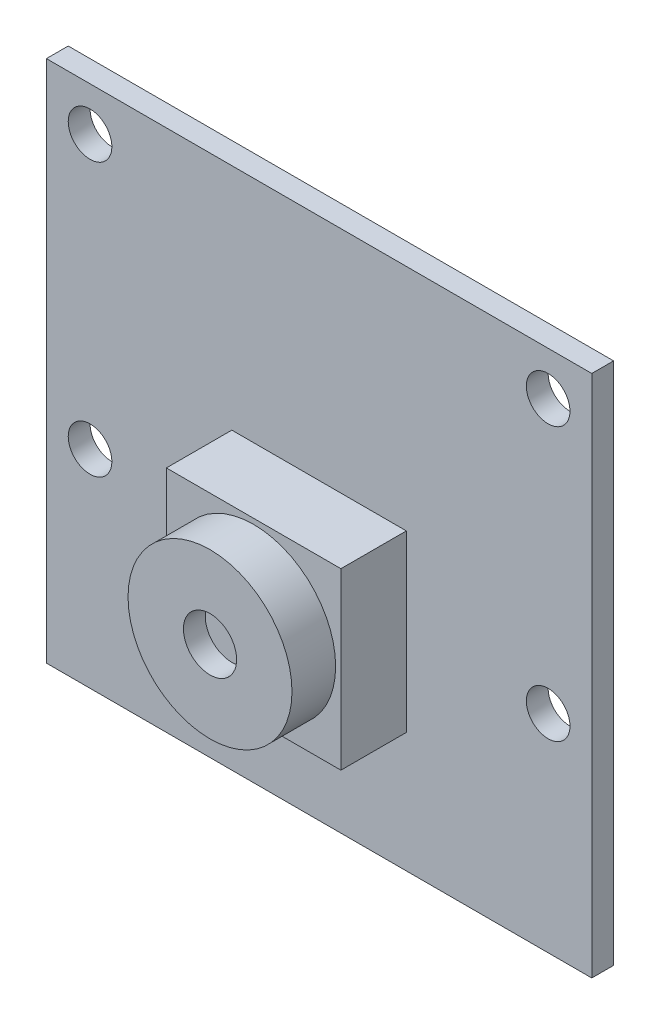
ISO-10303-21;
HEADER;
FILE_DESCRIPTION(('STEP AP214'),'2;1');
FILE_NAME('part.step','',(''),(''),'','','');
FILE_SCHEMA(('AUTOMOTIVE_DESIGN { 1 0 10303 214 1 1 1 1 }'));
ENDSEC;
DATA;
#1=APPLICATION_CONTEXT('core data for automotive mechanical design processes');
#2=APPLICATION_PROTOCOL_DEFINITION('international standard','automotive_design',2000,#1);
#3=PRODUCT_CONTEXT('',#1,'mechanical');
#4=PRODUCT('Part','Part','',(#3));
#5=PRODUCT_RELATED_PRODUCT_CATEGORY('part','',(#4));
#6=PRODUCT_DEFINITION_FORMATION('','',#4);
#7=PRODUCT_DEFINITION_CONTEXT('part definition',#1,'design');
#8=PRODUCT_DEFINITION('design','',#6,#7);
#9=PRODUCT_DEFINITION_SHAPE('','',#8);
#10=(LENGTH_UNIT() NAMED_UNIT(*) SI_UNIT(.MILLI.,.METRE.));
#11=(NAMED_UNIT(*) PLANE_ANGLE_UNIT() SI_UNIT($,.RADIAN.));
#12=(NAMED_UNIT(*) SI_UNIT($,.STERADIAN.) SOLID_ANGLE_UNIT());
#13=UNCERTAINTY_MEASURE_WITH_UNIT(LENGTH_MEASURE(1.E-05),#10,'distance_accuracy_value','');
#14=(GEOMETRIC_REPRESENTATION_CONTEXT(3) GLOBAL_UNCERTAINTY_ASSIGNED_CONTEXT((#13)) GLOBAL_UNIT_ASSIGNED_CONTEXT((#10,
#11,#12)) REPRESENTATION_CONTEXT('',''));
#15=CARTESIAN_POINT('',(0.,0.,0.));
#16=DIRECTION('',(0.,0.,1.));
#17=DIRECTION('',(1.,0.,0.));
#18=AXIS2_PLACEMENT_3D('',#15,#16,#17);
#19=CARTESIAN_POINT('',(0.,-2.50000000000002,6.));
#20=DIRECTION('',(0.,0.,-1.));
#21=DIRECTION('',(-1.,0.,0.));
#22=AXIS2_PLACEMENT_3D('',#19,#20,#21);
#23=CYLINDRICAL_SURFACE('',#22,3.75777799068408);
#24=CARTESIAN_POINT('',(0.,-2.50000000000002,6.));
#25=DIRECTION('',(0.,0.,1.));
#26=DIRECTION('',(1.,0.,0.));
#27=AXIS2_PLACEMENT_3D('',#24,#25,#26);
#28=CIRCLE('',#27,3.75777799068408);
#29=CARTESIAN_POINT('',(3.75777799068408,-2.50000000000002,6.));
#30=VERTEX_POINT('',#29);
#31=EDGE_CURVE('E11',#30,#30,#28,.T.);
#32=ORIENTED_EDGE('',*,*,#31,.F.);
#33=EDGE_LOOP('',(#32));
#34=FACE_BOUND('',#33,.T.);
#35=CARTESIAN_POINT('',(0.,-2.50000000000002,4.));
#36=DIRECTION('',(0.,0.,1.));
#37=DIRECTION('',(1.,0.,0.));
#38=AXIS2_PLACEMENT_3D('',#35,#36,#37);
#39=CIRCLE('',#38,3.75777799068408);
#40=CARTESIAN_POINT('',(3.75777799068408,-2.50000000000002,4.));
#41=VERTEX_POINT('',#40);
#42=EDGE_CURVE('E53',#41,#41,#39,.T.);
#43=ORIENTED_EDGE('',*,*,#42,.T.);
#44=EDGE_LOOP('',(#43));
#45=FACE_BOUND('',#44,.T.);
#46=ADVANCED_FACE('F50',(#34,#45),#23,.T.);
#47=CARTESIAN_POINT('',(0.,-2.50000000000002,6.));
#48=DIRECTION('',(0.,0.,1.));
#49=DIRECTION('',(1.,0.,0.));
#50=AXIS2_PLACEMENT_3D('',#47,#48,#49);
#51=PLANE('',#50);
#52=CARTESIAN_POINT('',(0.,-2.50000000000002,6.));
#53=DIRECTION('',(0.,0.,1.));
#54=DIRECTION('',(1.,0.,0.));
#55=AXIS2_PLACEMENT_3D('',#52,#53,#54);
#56=CIRCLE('',#55,1.21903368647642);
#57=CARTESIAN_POINT('',(1.21903368647642,-2.50000000000002,6.));
#58=VERTEX_POINT('',#57);
#59=EDGE_CURVE('E62',#58,#58,#56,.T.);
#60=ORIENTED_EDGE('',*,*,#59,.F.);
#61=EDGE_LOOP('',(#60));
#62=FACE_BOUND('',#61,.T.);
#63=ORIENTED_EDGE('',*,*,#31,.T.);
#64=EDGE_LOOP('',(#63));
#65=FACE_BOUND('',#64,.T.);
#66=ADVANCED_FACE('F77',(#62,#65),#51,.T.);
#67=CARTESIAN_POINT('',(0.,-2.50000000000002,4.));
#68=DIRECTION('',(0.,0.,1.));
#69=DIRECTION('',(1.,0.,0.));
#70=AXIS2_PLACEMENT_3D('',#67,#68,#69);
#71=PLANE('',#70);
#72=ORIENTED_EDGE('',*,*,#42,.F.);
#73=EDGE_LOOP('',(#72));
#74=FACE_BOUND('',#73,.T.);
#75=ADVANCED_FACE('F73',(#74),#71,.F.);
#76=CARTESIAN_POINT('',(0.,-2.50000000000002,5.));
#77=DIRECTION('',(0.,0.,1.));
#78=DIRECTION('',(1.,0.,0.));
#79=AXIS2_PLACEMENT_3D('',#76,#77,#78);
#80=CYLINDRICAL_SURFACE('',#79,1.21903368647642);
#81=CARTESIAN_POINT('',(0.,-2.50000000000002,5.));
#82=DIRECTION('',(0.,0.,1.));
#83=DIRECTION('',(1.,0.,0.));
#84=AXIS2_PLACEMENT_3D('',#81,#82,#83);
#85=CIRCLE('',#84,1.21903368647642);
#86=CARTESIAN_POINT('',(1.21903368647642,-2.50000000000002,5.));
#87=VERTEX_POINT('',#86);
#88=EDGE_CURVE('E60',#87,#87,#85,.T.);
#89=ORIENTED_EDGE('',*,*,#88,.F.);
#90=EDGE_LOOP('',(#89));
#91=FACE_BOUND('',#90,.T.);
#92=ORIENTED_EDGE('',*,*,#59,.T.);
#93=EDGE_LOOP('',(#92));
#94=FACE_BOUND('',#93,.T.);
#95=ADVANCED_FACE('F70',(#91,#94),#80,.F.);
#96=CARTESIAN_POINT('',(0.,-2.50000000000002,5.));
#97=DIRECTION('',(0.,0.,1.));
#98=DIRECTION('',(1.,0.,0.));
#99=AXIS2_PLACEMENT_3D('',#96,#97,#98);
#100=PLANE('',#99);
#101=ORIENTED_EDGE('',*,*,#88,.T.);
#102=EDGE_LOOP('',(#101));
#103=FACE_BOUND('',#102,.T.);
#104=ADVANCED_FACE('F68',(#103),#100,.T.);
#105=CLOSED_SHELL('',(#46,#66,#75,#95,#104));
#106=MANIFOLD_SOLID_BREP('B2',#105);
#107=CARTESIAN_POINT('',(4.,-6.5,4.));
#108=DIRECTION('',(-1.,0.,0.));
#109=DIRECTION('',(0.,-1.,0.));
#110=AXIS2_PLACEMENT_3D('',#107,#108,#109);
#111=PLANE('',#110);
#112=DIRECTION('',(0.,1.,0.));
#113=VECTOR('',#112,1.);
#114=CARTESIAN_POINT('',(4.,-6.5,1.));
#115=LINE('',#114,#113);
#116=CARTESIAN_POINT('',(4.,-6.5,1.));
#117=VERTEX_POINT('',#116);
#118=CARTESIAN_POINT('',(4.,1.5,1.));
#119=VERTEX_POINT('',#118);
#120=EDGE_CURVE('E194',#117,#119,#115,.T.);
#121=ORIENTED_EDGE('',*,*,#120,.T.);
#122=DIRECTION('',(0.,0.,-1.));
#123=VECTOR('',#122,1.);
#124=CARTESIAN_POINT('',(4.,1.5,4.));
#125=LINE('',#124,#123);
#126=CARTESIAN_POINT('',(4.,1.5,4.));
#127=VERTEX_POINT('',#126);
#128=EDGE_CURVE('E48',#127,#119,#125,.T.);
#129=ORIENTED_EDGE('',*,*,#128,.F.);
#130=DIRECTION('',(0.,1.,0.));
#131=VECTOR('',#130,1.);
#132=CARTESIAN_POINT('',(4.,-6.5,4.));
#133=LINE('',#132,#131);
#134=CARTESIAN_POINT('',(4.,-6.5,4.));
#135=VERTEX_POINT('',#134);
#136=EDGE_CURVE('E182',#135,#127,#133,.T.);
#137=ORIENTED_EDGE('',*,*,#136,.F.);
#138=DIRECTION('',(0.,0.,-1.));
#139=VECTOR('',#138,1.);
#140=CARTESIAN_POINT('',(4.,-6.5,4.));
#141=LINE('',#140,#139);
#142=EDGE_CURVE('E190',#135,#117,#141,.T.);
#143=ORIENTED_EDGE('',*,*,#142,.T.);
#144=EDGE_LOOP('',(#121,#129,#137,#143));
#145=FACE_BOUND('',#144,.T.);
#146=ADVANCED_FACE('F131',(#145),#111,.F.);
#147=CARTESIAN_POINT('',(-4.,1.5,4.));
#148=DIRECTION('',(0.,-1.,0.));
#149=DIRECTION('',(0.,0.,-1.));
#150=AXIS2_PLACEMENT_3D('',#147,#148,#149);
#151=PLANE('',#150);
#152=DIRECTION('',(-1.,0.,0.));
#153=VECTOR('',#152,1.);
#154=CARTESIAN_POINT('',(-4.,1.5,1.));
#155=LINE('',#154,#153);
#156=CARTESIAN_POINT('',(-4.,1.5,1.));
#157=VERTEX_POINT('',#156);
#158=EDGE_CURVE('E186',#119,#157,#155,.T.);
#159=ORIENTED_EDGE('',*,*,#158,.T.);
#160=DIRECTION('',(0.,0.,-1.));
#161=VECTOR('',#160,1.);
#162=CARTESIAN_POINT('',(-4.,1.5,4.));
#163=LINE('',#162,#161);
#164=CARTESIAN_POINT('',(-4.,1.5,4.));
#165=VERTEX_POINT('',#164);
#166=EDGE_CURVE('E139',#165,#157,#163,.T.);
#167=ORIENTED_EDGE('',*,*,#166,.F.);
#168=DIRECTION('',(-1.,0.,0.));
#169=VECTOR('',#168,1.);
#170=CARTESIAN_POINT('',(-4.,1.5,4.));
#171=LINE('',#170,#169);
#172=EDGE_CURVE('E177',#127,#165,#171,.T.);
#173=ORIENTED_EDGE('',*,*,#172,.F.);
#174=ORIENTED_EDGE('',*,*,#128,.T.);
#175=EDGE_LOOP('',(#159,#167,#173,#174));
#176=FACE_BOUND('',#175,.T.);
#177=ADVANCED_FACE('F185',(#176),#151,.F.);
#178=CARTESIAN_POINT('',(-4.,-6.5,4.));
#179=DIRECTION('',(1.,0.,0.));
#180=DIRECTION('',(0.,1.,0.));
#181=AXIS2_PLACEMENT_3D('',#178,#179,#180);
#182=PLANE('',#181);
#183=DIRECTION('',(0.,-1.,0.));
#184=VECTOR('',#183,1.);
#185=CARTESIAN_POINT('',(-4.,-6.5,1.));
#186=LINE('',#185,#184);
#187=CARTESIAN_POINT('',(-4.,-6.5,1.));
#188=VERTEX_POINT('',#187);
#189=EDGE_CURVE('E164',#157,#188,#186,.T.);
#190=ORIENTED_EDGE('',*,*,#189,.T.);
#191=DIRECTION('',(0.,0.,-1.));
#192=VECTOR('',#191,1.);
#193=CARTESIAN_POINT('',(-4.,-6.5,4.));
#194=LINE('',#193,#192);
#195=CARTESIAN_POINT('',(-4.,-6.5,4.));
#196=VERTEX_POINT('',#195);
#197=EDGE_CURVE('E187',#196,#188,#194,.T.);
#198=ORIENTED_EDGE('',*,*,#197,.F.);
#199=DIRECTION('',(0.,-1.,0.));
#200=VECTOR('',#199,1.);
#201=CARTESIAN_POINT('',(-4.,-6.5,4.));
#202=LINE('',#201,#200);
#203=EDGE_CURVE('E180',#165,#196,#202,.T.);
#204=ORIENTED_EDGE('',*,*,#203,.F.);
#205=ORIENTED_EDGE('',*,*,#166,.T.);
#206=EDGE_LOOP('',(#190,#198,#204,#205));
#207=FACE_BOUND('',#206,.T.);
#208=ADVANCED_FACE('F188',(#207),#182,.F.);
#209=CARTESIAN_POINT('',(-4.,-6.5,4.));
#210=DIRECTION('',(0.,1.,0.));
#211=DIRECTION('',(0.,0.,1.));
#212=AXIS2_PLACEMENT_3D('',#209,#210,#211);
#213=PLANE('',#212);
#214=DIRECTION('',(1.,0.,0.));
#215=VECTOR('',#214,1.);
#216=CARTESIAN_POINT('',(-4.,-6.5,1.));
#217=LINE('',#216,#215);
#218=EDGE_CURVE('E170',#188,#117,#217,.T.);
#219=ORIENTED_EDGE('',*,*,#218,.T.);
#220=ORIENTED_EDGE('',*,*,#142,.F.);
#221=DIRECTION('',(1.,0.,0.));
#222=VECTOR('',#221,1.);
#223=CARTESIAN_POINT('',(-4.,-6.5,4.));
#224=LINE('',#223,#222);
#225=EDGE_CURVE('E147',#196,#135,#224,.T.);
#226=ORIENTED_EDGE('',*,*,#225,.F.);
#227=ORIENTED_EDGE('',*,*,#197,.T.);
#228=EDGE_LOOP('',(#219,#220,#226,#227));
#229=FACE_BOUND('',#228,.T.);
#230=ADVANCED_FACE('F201',(#229),#213,.F.);
#231=CARTESIAN_POINT('',(0.,0.,4.));
#232=DIRECTION('',(0.,0.,-1.));
#233=DIRECTION('',(-1.,0.,0.));
#234=AXIS2_PLACEMENT_3D('',#231,#232,#233);
#235=PLANE('',#234);
#236=ORIENTED_EDGE('',*,*,#136,.T.);
#237=ORIENTED_EDGE('',*,*,#172,.T.);
#238=ORIENTED_EDGE('',*,*,#203,.T.);
#239=ORIENTED_EDGE('',*,*,#225,.T.);
#240=EDGE_LOOP('',(#236,#237,#238,#239));
#241=FACE_BOUND('',#240,.T.);
#242=ADVANCED_FACE('F178',(#241),#235,.F.);
#243=CARTESIAN_POINT('',(0.,0.,1.));
#244=DIRECTION('',(0.,0.,-1.));
#245=DIRECTION('',(-1.,0.,0.));
#246=AXIS2_PLACEMENT_3D('',#243,#244,#245);
#247=PLANE('',#246);
#248=ORIENTED_EDGE('',*,*,#120,.F.);
#249=ORIENTED_EDGE('',*,*,#218,.F.);
#250=ORIENTED_EDGE('',*,*,#189,.F.);
#251=ORIENTED_EDGE('',*,*,#158,.F.);
#252=EDGE_LOOP('',(#248,#249,#250,#251));
#253=FACE_BOUND('',#252,.T.);
#254=ADVANCED_FACE('F204',(#253),#247,.T.);
#255=CLOSED_SHELL('',(#146,#177,#208,#230,#242,#254));
#256=MANIFOLD_SOLID_BREP('B6',#255);
#257=CARTESIAN_POINT('',(12.5,-12.,1.));
#258=DIRECTION('',(-1.,0.,0.));
#259=DIRECTION('',(0.,0.,1.));
#260=AXIS2_PLACEMENT_3D('',#257,#258,#259);
#261=PLANE('',#260);
#262=DIRECTION('',(0.,1.,0.));
#263=VECTOR('',#262,1.);
#264=CARTESIAN_POINT('',(12.5,-12.,0.));
#265=LINE('',#264,#263);
#266=CARTESIAN_POINT('',(12.5,-12.,0.));
#267=VERTEX_POINT('',#266);
#268=CARTESIAN_POINT('',(12.5,12.,0.));
#269=VERTEX_POINT('',#268);
#270=EDGE_CURVE('E320',#267,#269,#265,.T.);
#271=ORIENTED_EDGE('',*,*,#270,.T.);
#272=DIRECTION('',(0.,0.,-1.));
#273=VECTOR('',#272,1.);
#274=CARTESIAN_POINT('',(12.5,12.,1.));
#275=LINE('',#274,#273);
#276=CARTESIAN_POINT('',(12.5,12.,1.));
#277=VERTEX_POINT('',#276);
#278=EDGE_CURVE('E129',#277,#269,#275,.T.);
#279=ORIENTED_EDGE('',*,*,#278,.F.);
#280=DIRECTION('',(0.,1.,0.));
#281=VECTOR('',#280,1.);
#282=CARTESIAN_POINT('',(12.5,-12.,1.));
#283=LINE('',#282,#281);
#284=CARTESIAN_POINT('',(12.5,-12.,1.));
#285=VERTEX_POINT('',#284);
#286=EDGE_CURVE('E308',#285,#277,#283,.T.);
#287=ORIENTED_EDGE('',*,*,#286,.F.);
#288=DIRECTION('',(0.,0.,-1.));
#289=VECTOR('',#288,1.);
#290=CARTESIAN_POINT('',(12.5,-12.,1.));
#291=LINE('',#290,#289);
#292=EDGE_CURVE('E316',#285,#267,#291,.T.);
#293=ORIENTED_EDGE('',*,*,#292,.T.);
#294=EDGE_LOOP('',(#271,#279,#287,#293));
#295=FACE_BOUND('',#294,.T.);
#296=ADVANCED_FACE('F257',(#295),#261,.F.);
#297=CARTESIAN_POINT('',(-12.5,12.,1.));
#298=DIRECTION('',(0.,-1.,0.));
#299=DIRECTION('',(0.,0.,-1.));
#300=AXIS2_PLACEMENT_3D('',#297,#298,#299);
#301=PLANE('',#300);
#302=DIRECTION('',(-1.,0.,0.));
#303=VECTOR('',#302,1.);
#304=CARTESIAN_POINT('',(-12.5,12.,0.));
#305=LINE('',#304,#303);
#306=CARTESIAN_POINT('',(-12.5,12.,0.));
#307=VERTEX_POINT('',#306);
#308=EDGE_CURVE('E312',#269,#307,#305,.T.);
#309=ORIENTED_EDGE('',*,*,#308,.T.);
#310=DIRECTION('',(0.,0.,-1.));
#311=VECTOR('',#310,1.);
#312=CARTESIAN_POINT('',(-12.5,12.,1.));
#313=LINE('',#312,#311);
#314=CARTESIAN_POINT('',(-12.5,12.,1.));
#315=VERTEX_POINT('',#314);
#316=EDGE_CURVE('E265',#315,#307,#313,.T.);
#317=ORIENTED_EDGE('',*,*,#316,.F.);
#318=DIRECTION('',(-1.,0.,0.));
#319=VECTOR('',#318,1.);
#320=CARTESIAN_POINT('',(-12.5,12.,1.));
#321=LINE('',#320,#319);
#322=EDGE_CURVE('E303',#277,#315,#321,.T.);
#323=ORIENTED_EDGE('',*,*,#322,.F.);
#324=ORIENTED_EDGE('',*,*,#278,.T.);
#325=EDGE_LOOP('',(#309,#317,#323,#324));
#326=FACE_BOUND('',#325,.T.);
#327=ADVANCED_FACE('F311',(#326),#301,.F.);
#328=CARTESIAN_POINT('',(-12.5,-12.,1.));
#329=DIRECTION('',(1.,0.,0.));
#330=DIRECTION('',(0.,0.,-1.));
#331=AXIS2_PLACEMENT_3D('',#328,#329,#330);
#332=PLANE('',#331);
#333=DIRECTION('',(0.,-1.,0.));
#334=VECTOR('',#333,1.);
#335=CARTESIAN_POINT('',(-12.5,-12.,0.));
#336=LINE('',#335,#334);
#337=CARTESIAN_POINT('',(-12.5,-12.,0.));
#338=VERTEX_POINT('',#337);
#339=EDGE_CURVE('E290',#307,#338,#336,.T.);
#340=ORIENTED_EDGE('',*,*,#339,.T.);
#341=DIRECTION('',(0.,0.,-1.));
#342=VECTOR('',#341,1.);
#343=CARTESIAN_POINT('',(-12.5,-12.,1.));
#344=LINE('',#343,#342);
#345=CARTESIAN_POINT('',(-12.5,-12.,1.));
#346=VERTEX_POINT('',#345);
#347=EDGE_CURVE('E313',#346,#338,#344,.T.);
#348=ORIENTED_EDGE('',*,*,#347,.F.);
#349=DIRECTION('',(0.,-1.,0.));
#350=VECTOR('',#349,1.);
#351=CARTESIAN_POINT('',(-12.5,-12.,1.));
#352=LINE('',#351,#350);
#353=EDGE_CURVE('E306',#315,#346,#352,.T.);
#354=ORIENTED_EDGE('',*,*,#353,.F.);
#355=ORIENTED_EDGE('',*,*,#316,.T.);
#356=EDGE_LOOP('',(#340,#348,#354,#355));
#357=FACE_BOUND('',#356,.T.);
#358=ADVANCED_FACE('F314',(#357),#332,.F.);
#359=CARTESIAN_POINT('',(-12.5,-12.,1.));
#360=DIRECTION('',(0.,1.,0.));
#361=DIRECTION('',(0.,0.,1.));
#362=AXIS2_PLACEMENT_3D('',#359,#360,#361);
#363=PLANE('',#362);
#364=DIRECTION('',(1.,0.,0.));
#365=VECTOR('',#364,1.);
#366=CARTESIAN_POINT('',(-12.5,-12.,0.));
#367=LINE('',#366,#365);
#368=EDGE_CURVE('E296',#338,#267,#367,.T.);
#369=ORIENTED_EDGE('',*,*,#368,.T.);
#370=ORIENTED_EDGE('',*,*,#292,.F.);
#371=DIRECTION('',(1.,0.,0.));
#372=VECTOR('',#371,1.);
#373=CARTESIAN_POINT('',(-12.5,-12.,1.));
#374=LINE('',#373,#372);
#375=EDGE_CURVE('E273',#346,#285,#374,.T.);
#376=ORIENTED_EDGE('',*,*,#375,.F.);
#377=ORIENTED_EDGE('',*,*,#347,.T.);
#378=EDGE_LOOP('',(#369,#370,#376,#377));
#379=FACE_BOUND('',#378,.T.);
#380=ADVANCED_FACE('F328',(#379),#363,.F.);
#381=CARTESIAN_POINT('',(0.,0.,1.));
#382=DIRECTION('',(0.,0.,-1.));
#383=DIRECTION('',(-1.,0.,0.));
#384=AXIS2_PLACEMENT_3D('',#381,#382,#383);
#385=PLANE('',#384);
#386=CARTESIAN_POINT('',(10.5,-2.49999999999999,1.));
#387=DIRECTION('',(0.,0.,-1.));
#388=DIRECTION('',(-1.,0.,0.));
#389=AXIS2_PLACEMENT_3D('',#386,#387,#388);
#390=CIRCLE('',#389,1.);
#391=CARTESIAN_POINT('',(9.50000000000001,-2.49999999999999,1.));
#392=VERTEX_POINT('',#391);
#393=EDGE_CURVE('E323',#392,#392,#390,.T.);
#394=ORIENTED_EDGE('',*,*,#393,.T.);
#395=EDGE_LOOP('',(#394));
#396=FACE_BOUND('',#395,.T.);
#397=CARTESIAN_POINT('',(10.5,10.,1.));
#398=DIRECTION('',(0.,0.,-1.));
#399=DIRECTION('',(-1.,0.,0.));
#400=AXIS2_PLACEMENT_3D('',#397,#398,#399);
#401=CIRCLE('',#400,1.);
#402=CARTESIAN_POINT('',(9.5,10.,1.));
#403=VERTEX_POINT('',#402);
#404=EDGE_CURVE('E336',#403,#403,#401,.T.);
#405=ORIENTED_EDGE('',*,*,#404,.T.);
#406=EDGE_LOOP('',(#405));
#407=FACE_BOUND('',#406,.T.);
#408=CARTESIAN_POINT('',(-10.5,10.,1.));
#409=DIRECTION('',(0.,0.,-1.));
#410=DIRECTION('',(-1.,0.,0.));
#411=AXIS2_PLACEMENT_3D('',#408,#409,#410);
#412=CIRCLE('',#411,1.);
#413=CARTESIAN_POINT('',(-11.5,10.,1.));
#414=VERTEX_POINT('',#413);
#415=EDGE_CURVE('E339',#414,#414,#412,.T.);
#416=ORIENTED_EDGE('',*,*,#415,.T.);
#417=EDGE_LOOP('',(#416));
#418=FACE_BOUND('',#417,.T.);
#419=CARTESIAN_POINT('',(-10.5,-2.5,1.));
#420=DIRECTION('',(0.,0.,-1.));
#421=DIRECTION('',(-1.,0.,0.));
#422=AXIS2_PLACEMENT_3D('',#419,#420,#421);
#423=CIRCLE('',#422,1.);
#424=CARTESIAN_POINT('',(-11.5,-2.5,1.));
#425=VERTEX_POINT('',#424);
#426=EDGE_CURVE('E342',#425,#425,#423,.T.);
#427=ORIENTED_EDGE('',*,*,#426,.T.);
#428=EDGE_LOOP('',(#427));
#429=FACE_BOUND('',#428,.T.);
#430=ORIENTED_EDGE('',*,*,#286,.T.);
#431=ORIENTED_EDGE('',*,*,#322,.T.);
#432=ORIENTED_EDGE('',*,*,#353,.T.);
#433=ORIENTED_EDGE('',*,*,#375,.T.);
#434=EDGE_LOOP('',(#430,#431,#432,#433));
#435=FACE_BOUND('',#434,.T.);
#436=ADVANCED_FACE('F304',(#396,#407,#418,#429,#435),#385,.F.);
#437=CARTESIAN_POINT('',(0.,0.,0.));
#438=DIRECTION('',(0.,0.,-1.));
#439=DIRECTION('',(-1.,0.,0.));
#440=AXIS2_PLACEMENT_3D('',#437,#438,#439);
#441=PLANE('',#440);
#442=CARTESIAN_POINT('',(10.5,-2.49999999999999,0.));
#443=DIRECTION('',(0.,0.,1.));
#444=DIRECTION('',(1.,0.,0.));
#445=AXIS2_PLACEMENT_3D('',#442,#443,#444);
#446=CIRCLE('',#445,1.);
#447=CARTESIAN_POINT('',(11.5,-2.49999999999999,0.));
#448=VERTEX_POINT('',#447);
#449=EDGE_CURVE('E349',#448,#448,#446,.T.);
#450=ORIENTED_EDGE('',*,*,#449,.T.);
#451=EDGE_LOOP('',(#450));
#452=FACE_BOUND('',#451,.T.);
#453=CARTESIAN_POINT('',(10.5,10.,0.));
#454=DIRECTION('',(0.,0.,1.));
#455=DIRECTION('',(1.,0.,0.));
#456=AXIS2_PLACEMENT_3D('',#453,#454,#455);
#457=CIRCLE('',#456,1.);
#458=CARTESIAN_POINT('',(11.5,10.,0.));
#459=VERTEX_POINT('',#458);
#460=EDGE_CURVE('E352',#459,#459,#457,.T.);
#461=ORIENTED_EDGE('',*,*,#460,.T.);
#462=EDGE_LOOP('',(#461));
#463=FACE_BOUND('',#462,.T.);
#464=CARTESIAN_POINT('',(-10.5,10.,0.));
#465=DIRECTION('',(0.,0.,1.));
#466=DIRECTION('',(1.,0.,0.));
#467=AXIS2_PLACEMENT_3D('',#464,#465,#466);
#468=CIRCLE('',#467,1.);
#469=CARTESIAN_POINT('',(-9.5,10.,0.));
#470=VERTEX_POINT('',#469);
#471=EDGE_CURVE('E348',#470,#470,#468,.T.);
#472=ORIENTED_EDGE('',*,*,#471,.T.);
#473=EDGE_LOOP('',(#472));
#474=FACE_BOUND('',#473,.T.);
#475=CARTESIAN_POINT('',(-10.5,-2.5,0.));
#476=DIRECTION('',(0.,0.,1.));
#477=DIRECTION('',(1.,0.,0.));
#478=AXIS2_PLACEMENT_3D('',#475,#476,#477);
#479=CIRCLE('',#478,1.);
#480=CARTESIAN_POINT('',(-9.5,-2.5,0.));
#481=VERTEX_POINT('',#480);
#482=EDGE_CURVE('E345',#481,#481,#479,.T.);
#483=ORIENTED_EDGE('',*,*,#482,.T.);
#484=EDGE_LOOP('',(#483));
#485=FACE_BOUND('',#484,.T.);
#486=ORIENTED_EDGE('',*,*,#270,.F.);
#487=ORIENTED_EDGE('',*,*,#368,.F.);
#488=ORIENTED_EDGE('',*,*,#339,.F.);
#489=ORIENTED_EDGE('',*,*,#308,.F.);
#490=EDGE_LOOP('',(#486,#487,#488,#489));
#491=FACE_BOUND('',#490,.T.);
#492=ADVANCED_FACE('F331',(#452,#463,#474,#485,#491),#441,.T.);
#493=CARTESIAN_POINT('',(-10.5,-2.5,0.));
#494=DIRECTION('',(0.,0.,1.));
#495=DIRECTION('',(1.,0.,0.));
#496=AXIS2_PLACEMENT_3D('',#493,#494,#495);
#497=CYLINDRICAL_SURFACE('',#496,1.);
#498=ORIENTED_EDGE('',*,*,#482,.F.);
#499=EDGE_LOOP('',(#498));
#500=FACE_BOUND('',#499,.T.);
#501=ORIENTED_EDGE('',*,*,#426,.F.);
#502=EDGE_LOOP('',(#501));
#503=FACE_BOUND('',#502,.T.);
#504=ADVANCED_FACE('F364',(#500,#503),#497,.F.);
#505=CARTESIAN_POINT('',(-10.5,10.,0.));
#506=DIRECTION('',(0.,0.,1.));
#507=DIRECTION('',(1.,0.,0.));
#508=AXIS2_PLACEMENT_3D('',#505,#506,#507);
#509=CYLINDRICAL_SURFACE('',#508,1.);
#510=ORIENTED_EDGE('',*,*,#471,.F.);
#511=EDGE_LOOP('',(#510));
#512=FACE_BOUND('',#511,.T.);
#513=ORIENTED_EDGE('',*,*,#415,.F.);
#514=EDGE_LOOP('',(#513));
#515=FACE_BOUND('',#514,.T.);
#516=ADVANCED_FACE('F360',(#512,#515),#509,.F.);
#517=CARTESIAN_POINT('',(10.5,10.,0.));
#518=DIRECTION('',(0.,0.,1.));
#519=DIRECTION('',(1.,0.,0.));
#520=AXIS2_PLACEMENT_3D('',#517,#518,#519);
#521=CYLINDRICAL_SURFACE('',#520,1.);
#522=ORIENTED_EDGE('',*,*,#460,.F.);
#523=EDGE_LOOP('',(#522));
#524=FACE_BOUND('',#523,.T.);
#525=ORIENTED_EDGE('',*,*,#404,.F.);
#526=EDGE_LOOP('',(#525));
#527=FACE_BOUND('',#526,.T.);
#528=ADVANCED_FACE('F363',(#524,#527),#521,.F.);
#529=CARTESIAN_POINT('',(10.5,-2.49999999999999,0.));
#530=DIRECTION('',(0.,0.,1.));
#531=DIRECTION('',(1.,0.,0.));
#532=AXIS2_PLACEMENT_3D('',#529,#530,#531);
#533=CYLINDRICAL_SURFACE('',#532,1.);
#534=ORIENTED_EDGE('',*,*,#449,.F.);
#535=EDGE_LOOP('',(#534));
#536=FACE_BOUND('',#535,.T.);
#537=ORIENTED_EDGE('',*,*,#393,.F.);
#538=EDGE_LOOP('',(#537));
#539=FACE_BOUND('',#538,.T.);
#540=ADVANCED_FACE('F425',(#536,#539),#533,.F.);
#541=CLOSED_SHELL('',(#296,#327,#358,#380,#436,#492,#504,#516,#528,#540));
#542=MANIFOLD_SOLID_BREP('B42',#541);
#543=ADVANCED_BREP_SHAPE_REPRESENTATION('',(#18,#106,#256,#542),#14);
#544=SHAPE_DEFINITION_REPRESENTATION(#9,#543);
ENDSEC;
END-ISO-10303-21;
